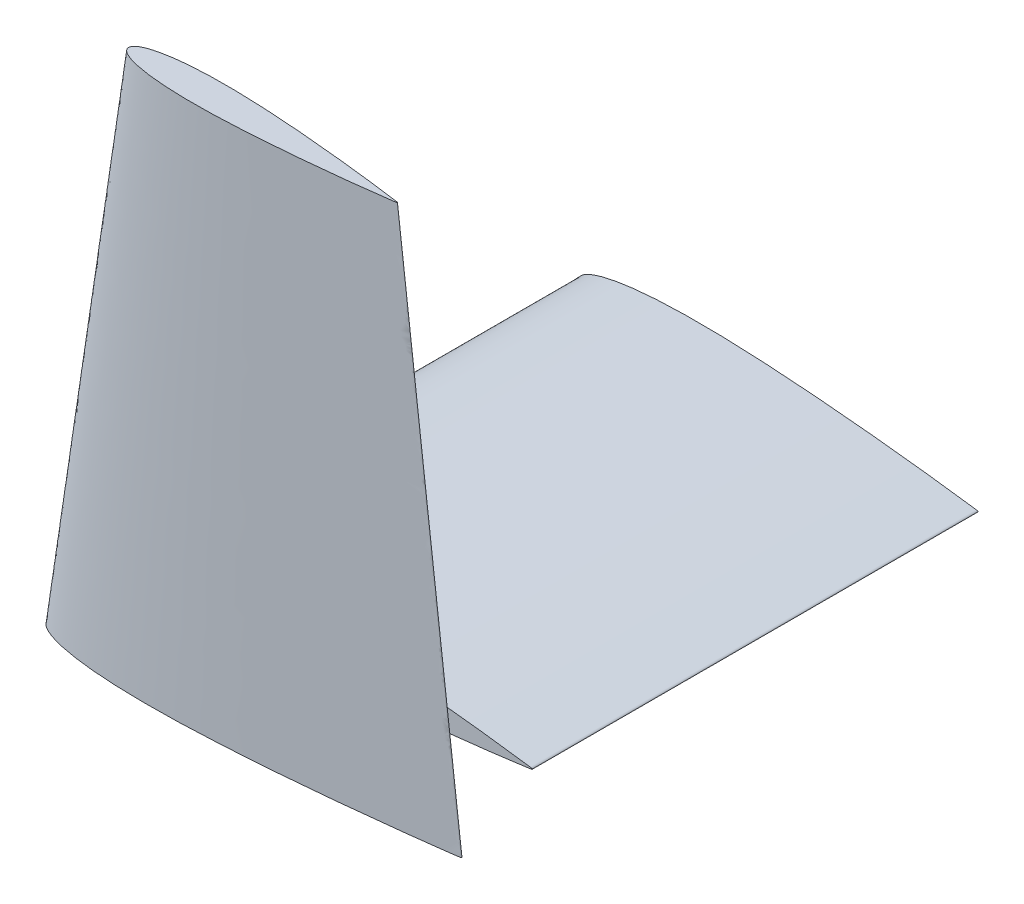
ISO-10303-21;
HEADER;
FILE_DESCRIPTION(('STEP AP214'),'2;1');
FILE_NAME('part.step','',(''),(''),'','','');
FILE_SCHEMA(('AUTOMOTIVE_DESIGN { 1 0 10303 214 1 1 1 1 }'));
ENDSEC;
DATA;
#1=APPLICATION_CONTEXT('core data for automotive mechanical design processes');
#2=APPLICATION_PROTOCOL_DEFINITION('international standard','automotive_design',2000,#1);
#3=PRODUCT_CONTEXT('',#1,'mechanical');
#4=PRODUCT('Part','Part','',(#3));
#5=PRODUCT_RELATED_PRODUCT_CATEGORY('part','',(#4));
#6=PRODUCT_DEFINITION_FORMATION('','',#4);
#7=PRODUCT_DEFINITION_CONTEXT('part definition',#1,'design');
#8=PRODUCT_DEFINITION('design','',#6,#7);
#9=PRODUCT_DEFINITION_SHAPE('','',#8);
#10=(LENGTH_UNIT() NAMED_UNIT(*) SI_UNIT(.MILLI.,.METRE.));
#11=(NAMED_UNIT(*) PLANE_ANGLE_UNIT() SI_UNIT($,.RADIAN.));
#12=(NAMED_UNIT(*) SI_UNIT($,.STERADIAN.) SOLID_ANGLE_UNIT());
#13=UNCERTAINTY_MEASURE_WITH_UNIT(LENGTH_MEASURE(1.E-05),#10,'distance_accuracy_value','');
#14=(GEOMETRIC_REPRESENTATION_CONTEXT(3) GLOBAL_UNCERTAINTY_ASSIGNED_CONTEXT((#13)) GLOBAL_UNIT_ASSIGNED_CONTEXT((#10,
#11,#12)) REPRESENTATION_CONTEXT('',''));
#15=CARTESIAN_POINT('',(0.,0.,0.));
#16=DIRECTION('',(0.,0.,1.));
#17=DIRECTION('',(1.,0.,0.));
#18=AXIS2_PLACEMENT_3D('',#15,#16,#17);
#19=CARTESIAN_POINT('',(25.4114796345118,365.759999999999,322.850976882838));
#20=DIRECTION('',(0.,1.,0.));
#21=DIRECTION('',(0.,0.,1.));
#22=AXIS2_PLACEMENT_3D('',#19,#20,#21);
#23=PLANE('',#22);
#24=CARTESIAN_POINT('',(239.522000000001,365.759999999999,322.310206280001));
#25=CARTESIAN_POINT('',(239.650719430013,365.759999999999,322.418074906855));
#26=CARTESIAN_POINT('',(239.650719430013,365.759999999999,322.94189803223));
#27=CARTESIAN_POINT('',(238.928971008814,365.759999999999,322.85351081366));
#28=CARTESIAN_POINT('',(238.014475706084,365.759999999999,323.110942112135));
#29=CARTESIAN_POINT('',(236.337412976432,365.759999999999,323.270058180235));
#30=CARTESIAN_POINT('',(234.078154780774,365.759999999999,323.611540782885));
#31=CARTESIAN_POINT('',(231.167891793945,365.759999999999,323.992612557069));
#32=CARTESIAN_POINT('',(227.658298365245,365.759999999999,324.462266000062));
#33=CARTESIAN_POINT('',(223.558505404651,365.759999999999,324.993164600283));
#34=CARTESIAN_POINT('',(218.898201345534,365.759999999999,325.584251359278));
#35=CARTESIAN_POINT('',(213.704622899695,365.759999999999,326.22517141355));
#36=CARTESIAN_POINT('',(208.010259265294,365.759999999999,326.907250831037));
#37=CARTESIAN_POINT('',(201.850111776308,365.759999999999,327.62202983624));
#38=CARTESIAN_POINT('',(195.262114854154,365.759999999999,328.359776891957));
#39=CARTESIAN_POINT('',(188.286908751653,365.759999999999,329.111484703838));
#40=CARTESIAN_POINT('',(180.967547263005,365.759999999999,329.867816964566));
#41=CARTESIAN_POINT('',(173.349138879148,365.759999999999,330.619011283575));
#42=CARTESIAN_POINT('',(165.478674392035,365.759999999999,331.354523149108));
#43=CARTESIAN_POINT('',(157.404623531842,365.759999999999,332.064696808186));
#44=CARTESIAN_POINT('',(149.176853772931,365.759999999999,332.737659428311));
#45=CARTESIAN_POINT('',(140.845921161843,365.759999999999,333.362438327104));
#46=CARTESIAN_POINT('',(132.463264355408,365.759999999999,333.927433985806));
#47=CARTESIAN_POINT('',(124.080532245958,365.759999999999,334.420832832673));
#48=CARTESIAN_POINT('',(115.749330838517,365.759999999999,334.830169767844));
#49=CARTESIAN_POINT('',(107.52111336693,365.759999999999,335.144529441153));
#50=CARTESIAN_POINT('',(99.4463721558172,365.759999999999,335.353656259887));
#51=CARTESIAN_POINT('',(91.5750074581309,365.759999999999,335.447335678217));
#52=CARTESIAN_POINT('',(83.9553855531787,365.759999999999,335.418133257889));
#53=CARTESIAN_POINT('',(76.6344833966962,365.759999999999,335.260408315323));
#54=CARTESIAN_POINT('',(69.657364483313,365.759999999999,334.970162695653));
#55=CARTESIAN_POINT('',(63.0669743171658,365.759999999999,334.546637161582));
#56=CARTESIAN_POINT('',(56.9038176761964,365.759999999999,333.991106073461));
#57=CARTESIAN_POINT('',(51.2056086917376,365.759999999999,333.307908152888));
#58=CARTESIAN_POINT('',(46.0070797735594,365.759999999999,332.50285640304));
#59=CARTESIAN_POINT('',(41.3397327494167,365.759999999999,331.58435890138));
#60=CARTESIAN_POINT('',(37.2309235824555,365.759999999999,330.56280134437));
#61=CARTESIAN_POINT('',(33.7040003089124,365.759999999999,329.448145192101));
#62=CARTESIAN_POINT('',(30.7768820130327,365.759999999999,328.250771918545));
#63=CARTESIAN_POINT('',(28.4589033564982,365.759999999999,326.978782316796));
#64=CARTESIAN_POINT('',(26.7536311559698,365.759999999999,325.62966587169));
#65=CARTESIAN_POINT('',(25.6614181855516,365.759999999999,324.170784390789));
#66=CARTESIAN_POINT('',(25.2781698309896,365.759999999999,322.580000000001));
#67=CARTESIAN_POINT('',(25.6614181855516,365.759999999999,320.989215609212));
#68=CARTESIAN_POINT('',(26.7536311559699,365.759999999999,319.530334128311));
#69=CARTESIAN_POINT('',(28.4589033564982,365.759999999999,318.181217683206));
#70=CARTESIAN_POINT('',(30.7768820130327,365.759999999999,316.909228081456));
#71=CARTESIAN_POINT('',(33.7040003089124,365.759999999999,315.7118548079));
#72=CARTESIAN_POINT('',(37.2309235824555,365.759999999999,314.597198655631));
#73=CARTESIAN_POINT('',(41.3397327494167,365.759999999999,313.575641098621));
#74=CARTESIAN_POINT('',(46.0070797735594,365.759999999999,312.657143596961));
#75=CARTESIAN_POINT('',(51.2056086917376,365.759999999999,311.852091847113));
#76=CARTESIAN_POINT('',(56.9038176761964,365.759999999999,311.16889392654));
#77=CARTESIAN_POINT('',(63.0669743171658,365.759999999999,310.61336283842));
#78=CARTESIAN_POINT('',(69.657364483313,365.759999999999,310.189837304349));
#79=CARTESIAN_POINT('',(76.6344833966962,365.759999999999,309.899591684678));
#80=CARTESIAN_POINT('',(83.9553855531787,365.759999999999,309.741866742113));
#81=CARTESIAN_POINT('',(91.5750074581309,365.759999999999,309.712664321784));
#82=CARTESIAN_POINT('',(99.4463721558172,365.759999999999,309.806343740114));
#83=CARTESIAN_POINT('',(107.52111336693,365.759999999999,310.015470558848));
#84=CARTESIAN_POINT('',(115.749330838517,365.759999999999,310.329830232157));
#85=CARTESIAN_POINT('',(124.080532245958,365.759999999999,310.739167167329));
#86=CARTESIAN_POINT('',(132.463264355408,365.759999999999,311.232566014195));
#87=CARTESIAN_POINT('',(140.845921161843,365.759999999999,311.797561672898));
#88=CARTESIAN_POINT('',(149.176853772931,365.759999999999,312.42234057169));
#89=CARTESIAN_POINT('',(157.404623531842,365.759999999999,313.095303191815));
#90=CARTESIAN_POINT('',(165.478674392035,365.759999999999,313.805476850894));
#91=CARTESIAN_POINT('',(173.349138879148,365.759999999999,314.540988716426));
#92=CARTESIAN_POINT('',(180.967547263005,365.759999999999,315.292183035435));
#93=CARTESIAN_POINT('',(188.286908751653,365.759999999999,316.048515296164));
#94=CARTESIAN_POINT('',(195.262114854154,365.759999999999,316.800223108044));
#95=CARTESIAN_POINT('',(201.850111776308,365.759999999999,317.537970163762));
#96=CARTESIAN_POINT('',(208.010259265294,365.759999999999,318.252749168964));
#97=CARTESIAN_POINT('',(213.704622899695,365.759999999999,318.934828586451));
#98=CARTESIAN_POINT('',(218.898201345534,365.759999999999,319.575748640723));
#99=CARTESIAN_POINT('',(223.558505404651,365.759999999999,320.166835399719));
#100=CARTESIAN_POINT('',(227.658298365245,365.759999999999,320.697733999939));
#101=CARTESIAN_POINT('',(231.167891793945,365.759999999999,321.167387442933));
#102=CARTESIAN_POINT('',(234.078154780774,365.759999999999,321.548459217116));
#103=CARTESIAN_POINT('',(236.337412976431,365.759999999999,321.889941819767));
#104=CARTESIAN_POINT('',(238.014475706085,365.759999999999,322.049057887867));
#105=CARTESIAN_POINT('',(238.928971008813,365.759999999999,322.306489186341));
#106=CARTESIAN_POINT('',(239.442517560816,365.759999999999,322.243598918757));
#107=CARTESIAN_POINT('',(239.522000000001,365.759999999999,322.310206280001));
#108=B_SPLINE_CURVE_WITH_KNOTS('',3,(#24,#25,#26,#27,#28,#29,#30,#31,#32,#33,#34,#35,#36,#37,
#38,#39,#40,#41,#42,#43,#44,#45,#46,#47,#48,#49,#50,#51,#52,#53,#54,#55,#56,#57,#58,#59,#60,#61,
#62,#63,#64,#65,#66,#67,#68,#69,#70,#71,#72,#73,#74,#75,#76,#77,#78,#79,#80,#81,#82,#83,#84,#85,
#86,#87,#88,#89,#90,#91,#92,#93,#94,#95,#96,#97,#98,#99,#100,#101,#102,#103,#104,#105,#106,
#107),.UNSPECIFIED.,.T.,.F.,(4,1,1,1,1,1,1,1,1,1,1,1,1,1,1,1,1,1,1,1,1,1,1,1,1,1,1,1,1,1,1,1,1,
1,1,1,1,1,1,1,1,1,1,1,1,1,1,1,1,1,1,1,1,1,1,1,1,1,1,1,1,1,1,1,1,1,1,1,1,1,1,1,1,1,1,1,1,1,1,1,1,
4),(0.,0.0012343838014236,0.00199659845245215,0.00427909011224525,0.00806662934455282,
0.0133355596051821,0.0200519194601093,0.0281738385945457,0.0376492320599804,0.04841901239702,
0.0604147969012383,0.073562257415336,0.0877784448905718,0.102974964137976,0.119057720234998,
0.135925836009746,0.153474538248578,0.17159567376606,0.190175391650966,0.209099819247063,
0.228250461823925,0.247510079781424,0.266759327051319,0.285879349911867,0.304754502070085,
0.323268959175755,0.341312736715542,0.358776977043126,0.375559865722258,0.391564274673312,
0.406698273540518,0.420878185247108,0.434027755192764,0.44607820054461,0.456972304506158,
0.466663037034508,0.475120703886839,0.482336017878992,0.488336068220102,0.493209752146517,
0.497165061608803,0.500617191900712,0.504069322192621,0.508024631654908,0.512898315581322,
0.518898365922432,0.526113679914584,0.534571346766916,0.544262079295266,0.555156183256814,
0.56720662860866,0.580356198554316,0.594536110260906,0.609670109128112,0.625674518079166,
0.642457406758298,0.659921647085882,0.677965424625669,0.696479881731339,0.715355033889556,
0.734475056750105,0.753724304019999,0.772983921977499,0.792134564554361,0.811058992150458,
0.829638710035363,0.847759845552846,0.865308547791678,0.882176663566426,0.898259419663447,
0.913455938910852,0.927672126386088,0.940819586900185,0.952815371404404,0.963585151741443,
0.973060545206878,0.981182464341314,0.987898824196242,0.993167754456871,0.996955293689178,
0.999237785348971,1.),.UNSPECIFIED.);
#109=CARTESIAN_POINT('',(239.522000000001,365.759999999999,322.310206280001));
#110=VERTEX_POINT('',#109);
#111=EDGE_CURVE('E12',#110,#110,#108,.T.);
#112=ORIENTED_EDGE('',*,*,#111,.F.);
#113=EDGE_LOOP('',(#112));
#114=FACE_BOUND('',#113,.T.);
#115=ADVANCED_FACE('F53',(#114),#23,.T.);
#116=CARTESIAN_POINT('',(-38.0823652115158,-60.9600000000007,322.996269351453));
#117=DIRECTION('',(0.,-1.,0.));
#118=DIRECTION('',(0.,0.,-1.));
#119=AXIS2_PLACEMENT_3D('',#116,#117,#118);
#120=PLANE('',#119);
#121=CARTESIAN_POINT('',(290.830000000001,-60.9600000000009,322.1655482));
#122=CARTESIAN_POINT('',(290.70790064206,-60.9600000000009,322.063227283262));
#123=CARTESIAN_POINT('',(289.919000541415,-60.9600000000009,322.159838073916));
#124=CARTESIAN_POINT('',(288.514170865218,-60.9600000000009,321.764377182428));
#125=CARTESIAN_POINT('',(285.937900123936,-60.9600000000009,321.519946211859));
#126=CARTESIAN_POINT('',(282.467272172126,-60.9600000000009,320.995367361999));
#127=CARTESIAN_POINT('',(277.996583479429,-60.9600000000009,320.409972406402));
#128=CARTESIAN_POINT('',(272.605215163692,-60.9600000000009,319.688500035493));
#129=CARTESIAN_POINT('',(266.307193949018,-60.9600000000009,318.872944060065));
#130=CARTESIAN_POINT('',(259.148126622142,-60.9600000000009,317.964928220327));
#131=CARTESIAN_POINT('',(251.169853683398,-60.9600000000008,316.980359453681));
#132=CARTESIAN_POINT('',(242.422284399235,-60.9600000000008,315.932562483759));
#133=CARTESIAN_POINT('',(232.959187129677,-60.9600000000008,314.834533051092));
#134=CARTESIAN_POINT('',(222.838835985917,-60.9600000000008,313.701220551503));
#135=CARTESIAN_POINT('',(212.123661724069,-60.9600000000008,312.546461813204));
#136=CARTESIAN_POINT('',(200.879802734983,-60.9600000000008,311.384599087649));
#137=CARTESIAN_POINT('',(189.176553794183,-60.9600000000008,310.230629166988));
#138=CARTESIAN_POINT('',(177.086101230943,-60.9600000000008,309.100750322547));
#139=CARTESIAN_POINT('',(164.682903290314,-60.9600000000008,308.00979553191));
#140=CARTESIAN_POINT('',(152.043565404443,-60.9600000000008,306.97600360657));
#141=CARTESIAN_POINT('',(139.245750776495,-60.9600000000008,306.016230565127));
#142=CARTESIAN_POINT('',(126.368478458188,-60.9600000000008,305.148295359884));
#143=CARTESIAN_POINT('',(113.491090460871,-60.9600000000007,304.390345767129));
#144=CARTESIAN_POINT('',(100.69286291326,-60.9600000000007,303.761530427809));
#145=CARTESIAN_POINT('',(88.0528372599928,-60.9600000000007,303.27861728791));
#146=CARTESIAN_POINT('',(75.6485788158751,-60.9600000000007,302.957360787008));
#147=CARTESIAN_POINT('',(63.556743366879,-60.9600000000007,302.813452309264));
#148=CARTESIAN_POINT('',(51.8516302388682,-60.9600000000007,302.858312492331));
#149=CARTESIAN_POINT('',(40.6054045061933,-60.9600000000007,303.100606443248));
#150=CARTESIAN_POINT('',(29.8872918219332,-60.9600000000007,303.546476048791));
#151=CARTESIAN_POINT('',(19.7632642238779,-60.9600000000007,304.197087634345));
#152=CARTESIAN_POINT('',(10.2955443542987,-60.9600000000007,305.050483552633));
#153=CARTESIAN_POINT('',(1.54206791909804,-60.9600000000007,306.099998744972));
#154=CARTESIAN_POINT('',(-6.44380983777141,-60.9600000000007,307.336703390349));
#155=CARTESIAN_POINT('',(-13.6136964288326,-60.9600000000007,308.747681165734));
#156=CARTESIAN_POINT('',(-19.9255681621837,-60.9600000000007,310.316977768732));
#157=CARTESIAN_POINT('',(-25.3435582443167,-60.9600000000007,312.02929060051));
#158=CARTESIAN_POINT('',(-29.8401397308699,-60.9600000000007,313.868671845178));
#159=CARTESIAN_POINT('',(-33.4009728983814,-60.9600000000007,315.822677223904));
#160=CARTESIAN_POINT('',(-36.0205784733329,-60.9600000000007,317.895163340644));
#161=CARTESIAN_POINT('',(-37.6984145310929,-60.9600000000007,320.136268343926));
#162=CARTESIAN_POINT('',(-38.2871531066062,-60.9600000000007,322.58));
#163=CARTESIAN_POINT('',(-37.6984145310929,-60.9600000000007,325.023731656075));
#164=CARTESIAN_POINT('',(-36.0205784733329,-60.9600000000007,327.264836659357));
#165=CARTESIAN_POINT('',(-33.4009728983813,-60.9600000000007,329.337322776097));
#166=CARTESIAN_POINT('',(-29.8401397308699,-60.9600000000007,331.291328154822));
#167=CARTESIAN_POINT('',(-25.3435582443167,-60.9600000000007,333.130709399491));
#168=CARTESIAN_POINT('',(-19.9255681621836,-60.9600000000007,334.843022231268));
#169=CARTESIAN_POINT('',(-13.6136964288326,-60.9600000000007,336.412318834266));
#170=CARTESIAN_POINT('',(-6.44380983777134,-60.9600000000007,337.823296609652));
#171=CARTESIAN_POINT('',(1.542067919098,-60.9600000000007,339.060001255029));
#172=CARTESIAN_POINT('',(10.2955443542987,-60.9600000000007,340.109516447368));
#173=CARTESIAN_POINT('',(19.7632642238779,-60.9600000000007,340.962912365656));
#174=CARTESIAN_POINT('',(29.8872918219332,-60.9600000000007,341.613523951209));
#175=CARTESIAN_POINT('',(40.6054045061933,-60.9600000000007,342.059393556753));
#176=CARTESIAN_POINT('',(51.8516302388681,-60.9600000000007,342.301687507669));
#177=CARTESIAN_POINT('',(63.556743366879,-60.9600000000007,342.346547690736));
#178=CARTESIAN_POINT('',(75.648578815875,-60.9600000000007,342.202639212993));
#179=CARTESIAN_POINT('',(88.0528372599928,-60.9600000000008,341.881382712091));
#180=CARTESIAN_POINT('',(100.69286291326,-60.9600000000008,341.398469572192));
#181=CARTESIAN_POINT('',(113.491090460871,-60.9600000000008,340.769654232872));
#182=CARTESIAN_POINT('',(126.368478458188,-60.9600000000008,340.011704640117));
#183=CARTESIAN_POINT('',(139.245750776495,-60.9600000000008,339.143769434874));
#184=CARTESIAN_POINT('',(152.043565404443,-60.9600000000008,338.183996393431));
#185=CARTESIAN_POINT('',(164.682903290314,-60.9600000000008,337.150204468091));
#186=CARTESIAN_POINT('',(177.086101230943,-60.9600000000008,336.059249677454));
#187=CARTESIAN_POINT('',(189.176553794183,-60.9600000000008,334.929370833012));
#188=CARTESIAN_POINT('',(200.879802734983,-60.9600000000008,333.775400912352));
#189=CARTESIAN_POINT('',(212.123661724069,-60.9600000000008,332.613538186796));
#190=CARTESIAN_POINT('',(222.838835985917,-60.9600000000008,331.458779448498));
#191=CARTESIAN_POINT('',(232.959187129677,-60.9600000000008,330.325466948909));
#192=CARTESIAN_POINT('',(242.422284399235,-60.9600000000008,329.227437516242));
#193=CARTESIAN_POINT('',(251.169853683398,-60.9600000000009,328.179640546319));
#194=CARTESIAN_POINT('',(259.148126622142,-60.9600000000009,327.195071779673));
#195=CARTESIAN_POINT('',(266.307193949018,-60.9600000000009,326.287055939936));
#196=CARTESIAN_POINT('',(272.605215163692,-60.9600000000009,325.471499964508));
#197=CARTESIAN_POINT('',(277.996583479429,-60.9600000000009,324.750027593598));
#198=CARTESIAN_POINT('',(282.467272172126,-60.9600000000009,324.164632638002));
#199=CARTESIAN_POINT('',(285.937900123936,-60.9600000000009,323.640053788142));
#200=CARTESIAN_POINT('',(288.514170865218,-60.9600000000009,323.395622817573));
#201=CARTESIAN_POINT('',(289.919000541415,-60.9600000000009,323.000161926084));
#202=CARTESIAN_POINT('',(291.027736253697,-60.9600000000009,323.135940630769));
#203=CARTESIAN_POINT('',(291.027736253697,-60.9600000000009,322.331253860471));
#204=CARTESIAN_POINT('',(290.830000000001,-60.9600000000009,322.1655482));
#205=B_SPLINE_CURVE_WITH_KNOTS('',3,(#121,#122,#123,#124,#125,#126,#127,#128,#129,#130,#131,
#132,#133,#134,#135,#136,#137,#138,#139,#140,#141,#142,#143,#144,#145,#146,#147,#148,#149,#150,
#151,#152,#153,#154,#155,#156,#157,#158,#159,#160,#161,#162,#163,#164,#165,#166,#167,#168,#169,
#170,#171,#172,#173,#174,#175,#176,#177,#178,#179,#180,#181,#182,#183,#184,#185,#186,#187,#188,
#189,#190,#191,#192,#193,#194,#195,#196,#197,#198,#199,#200,#201,#202,#203,#204),.UNSPECIFIED.,
.T.,.F.,(4,1,1,1,1,1,1,1,1,1,1,1,1,1,1,1,1,1,1,1,1,1,1,1,1,1,1,1,1,1,1,1,1,1,1,1,1,1,1,1,1,1,1,
1,1,1,1,1,1,1,1,1,1,1,1,1,1,1,1,1,1,1,1,1,1,1,1,1,1,1,1,1,1,1,1,1,1,1,1,1,1,4),(0.,
0.000762214651028602,0.00304470631082167,0.00683224554312916,0.0121011758037585,
0.0188175356586858,0.026939454793122,0.0364148482585568,0.0471846285955963,0.0591804130998148,
0.0723278736139124,0.0865440610891483,0.101740580336553,0.117823336433574,0.134691452208322,
0.152240154447155,0.170361289964637,0.188941007849542,0.207865435445639,0.227016078022501,
0.246275695980001,0.265524943249896,0.284644966110444,0.303520118268662,0.322034575374331,
0.340078352914118,0.357542593241702,0.374325481920834,0.390329890871888,0.405463889739095,
0.419643801445685,0.43279337139134,0.444843816743186,0.455737920704734,0.465428653233084,
0.473886320085416,0.481101634077568,0.487101684418678,0.491975368345093,0.495930677807379,
0.499382808099288,0.502834938391198,0.506790247853484,0.511663931779899,0.517663982121008,
0.524879296113161,0.533336962965492,0.543027695493843,0.553921799455391,0.565972244807237,
0.579121814752892,0.593301726459482,0.608435725326689,0.624440134277742,0.641223022956875,
0.658687263284458,0.676731040824245,0.695245497929915,0.714120650088133,0.733240672948681,
0.752489920218576,0.771749538176075,0.790900180752937,0.809824608349034,0.82840432623394,
0.846525461751422,0.864074163990254,0.880942279765002,0.897025035862024,0.912221555109428,
0.926437742584664,0.939585203098762,0.95158098760298,0.96235076794002,0.971826161405455,
0.979948080539891,0.986664440394818,0.991933370655447,0.995720909887755,0.998003401547548,
0.998765616198576,1.),.UNSPECIFIED.);
#206=CARTESIAN_POINT('',(290.830000000001,-60.9600000000009,322.1655482));
#207=VERTEX_POINT('',#206);
#208=EDGE_CURVE('E63',#207,#207,#205,.T.);
#209=ORIENTED_EDGE('',*,*,#208,.F.);
#210=EDGE_LOOP('',(#209));
#211=FACE_BOUND('',#210,.T.);
#212=ADVANCED_FACE('F93',(#211),#120,.T.);
#213=CARTESIAN_POINT('',(290.830000000001,-60.9600000000009,322.1655482));
#214=CARTESIAN_POINT('',(239.522000000001,365.759999999999,322.310206280001));
#215=CARTESIAN_POINT('',(290.70790064206,-60.9600000000009,322.063227283262));
#216=CARTESIAN_POINT('',(239.442517560816,365.759999999999,322.243598918757));
#217=CARTESIAN_POINT('',(289.919000541415,-60.9600000000009,322.159838073916));
#218=CARTESIAN_POINT('',(238.928971008813,365.759999999999,322.306489186341));
#219=CARTESIAN_POINT('',(288.514170865218,-60.9600000000009,321.764377182428));
#220=CARTESIAN_POINT('',(238.014475706085,365.759999999999,322.049057887867));
#221=CARTESIAN_POINT('',(285.937900123936,-60.9600000000009,321.519946211859));
#222=CARTESIAN_POINT('',(236.337412976431,365.759999999999,321.889941819767));
#223=CARTESIAN_POINT('',(282.467272172126,-60.9600000000009,320.995367361999));
#224=CARTESIAN_POINT('',(234.078154780774,365.759999999999,321.548459217116));
#225=CARTESIAN_POINT('',(277.996583479429,-60.9600000000009,320.409972406402));
#226=CARTESIAN_POINT('',(231.167891793945,365.759999999999,321.167387442933));
#227=CARTESIAN_POINT('',(272.605215163692,-60.9600000000009,319.688500035493));
#228=CARTESIAN_POINT('',(227.658298365245,365.759999999999,320.697733999939));
#229=CARTESIAN_POINT('',(266.307193949018,-60.9600000000009,318.872944060065));
#230=CARTESIAN_POINT('',(223.558505404651,365.759999999999,320.166835399719));
#231=CARTESIAN_POINT('',(259.148126622142,-60.9600000000009,317.964928220327));
#232=CARTESIAN_POINT('',(218.898201345534,365.759999999999,319.575748640723));
#233=CARTESIAN_POINT('',(251.169853683398,-60.9600000000008,316.980359453681));
#234=CARTESIAN_POINT('',(213.704622899695,365.759999999999,318.934828586451));
#235=CARTESIAN_POINT('',(242.422284399235,-60.9600000000008,315.932562483759));
#236=CARTESIAN_POINT('',(208.010259265294,365.759999999999,318.252749168964));
#237=CARTESIAN_POINT('',(232.959187129677,-60.9600000000008,314.834533051092));
#238=CARTESIAN_POINT('',(201.850111776308,365.759999999999,317.537970163762));
#239=CARTESIAN_POINT('',(222.838835985917,-60.9600000000008,313.701220551503));
#240=CARTESIAN_POINT('',(195.262114854154,365.759999999999,316.800223108044));
#241=CARTESIAN_POINT('',(212.123661724069,-60.9600000000008,312.546461813204));
#242=CARTESIAN_POINT('',(188.286908751653,365.759999999999,316.048515296164));
#243=CARTESIAN_POINT('',(200.879802734983,-60.9600000000008,311.384599087649));
#244=CARTESIAN_POINT('',(180.967547263005,365.759999999999,315.292183035435));
#245=CARTESIAN_POINT('',(189.176553794183,-60.9600000000008,310.230629166988));
#246=CARTESIAN_POINT('',(173.349138879148,365.759999999999,314.540988716426));
#247=CARTESIAN_POINT('',(177.086101230943,-60.9600000000008,309.100750322547));
#248=CARTESIAN_POINT('',(165.478674392035,365.759999999999,313.805476850894));
#249=CARTESIAN_POINT('',(164.682903290314,-60.9600000000008,308.00979553191));
#250=CARTESIAN_POINT('',(157.404623531842,365.759999999999,313.095303191815));
#251=CARTESIAN_POINT('',(152.043565404443,-60.9600000000008,306.97600360657));
#252=CARTESIAN_POINT('',(149.176853772931,365.759999999999,312.42234057169));
#253=CARTESIAN_POINT('',(139.245750776495,-60.9600000000008,306.016230565127));
#254=CARTESIAN_POINT('',(140.845921161843,365.759999999999,311.797561672898));
#255=CARTESIAN_POINT('',(126.368478458188,-60.9600000000008,305.148295359884));
#256=CARTESIAN_POINT('',(132.463264355408,365.759999999999,311.232566014195));
#257=CARTESIAN_POINT('',(113.491090460871,-60.9600000000007,304.390345767129));
#258=CARTESIAN_POINT('',(124.080532245958,365.759999999999,310.739167167329));
#259=CARTESIAN_POINT('',(100.69286291326,-60.9600000000007,303.761530427809));
#260=CARTESIAN_POINT('',(115.749330838517,365.759999999999,310.329830232157));
#261=CARTESIAN_POINT('',(88.0528372599928,-60.9600000000007,303.27861728791));
#262=CARTESIAN_POINT('',(107.52111336693,365.759999999999,310.015470558848));
#263=CARTESIAN_POINT('',(75.6485788158751,-60.9600000000007,302.957360787008));
#264=CARTESIAN_POINT('',(99.4463721558172,365.759999999999,309.806343740114));
#265=CARTESIAN_POINT('',(63.556743366879,-60.9600000000007,302.813452309264));
#266=CARTESIAN_POINT('',(91.5750074581309,365.759999999999,309.712664321784));
#267=CARTESIAN_POINT('',(51.8516302388682,-60.9600000000007,302.858312492331));
#268=CARTESIAN_POINT('',(83.9553855531787,365.759999999999,309.741866742113));
#269=CARTESIAN_POINT('',(40.6054045061933,-60.9600000000007,303.100606443248));
#270=CARTESIAN_POINT('',(76.6344833966962,365.759999999999,309.899591684678));
#271=CARTESIAN_POINT('',(29.8872918219332,-60.9600000000007,303.546476048791));
#272=CARTESIAN_POINT('',(69.657364483313,365.759999999999,310.189837304349));
#273=CARTESIAN_POINT('',(19.7632642238779,-60.9600000000007,304.197087634345));
#274=CARTESIAN_POINT('',(63.0669743171658,365.759999999999,310.61336283842));
#275=CARTESIAN_POINT('',(10.2955443542987,-60.9600000000007,305.050483552633));
#276=CARTESIAN_POINT('',(56.9038176761964,365.759999999999,311.16889392654));
#277=CARTESIAN_POINT('',(1.54206791909804,-60.9600000000007,306.099998744972));
#278=CARTESIAN_POINT('',(51.2056086917376,365.759999999999,311.852091847113));
#279=CARTESIAN_POINT('',(-6.44380983777141,-60.9600000000007,307.336703390349));
#280=CARTESIAN_POINT('',(46.0070797735594,365.759999999999,312.657143596961));
#281=CARTESIAN_POINT('',(-13.6136964288326,-60.9600000000007,308.747681165734));
#282=CARTESIAN_POINT('',(41.3397327494167,365.759999999999,313.575641098621));
#283=CARTESIAN_POINT('',(-19.9255681621837,-60.9600000000007,310.316977768732));
#284=CARTESIAN_POINT('',(37.2309235824555,365.759999999999,314.597198655631));
#285=CARTESIAN_POINT('',(-25.3435582443167,-60.9600000000007,312.02929060051));
#286=CARTESIAN_POINT('',(33.7040003089124,365.759999999999,315.7118548079));
#287=CARTESIAN_POINT('',(-29.8401397308699,-60.9600000000007,313.868671845178));
#288=CARTESIAN_POINT('',(30.7768820130327,365.759999999999,316.909228081456));
#289=CARTESIAN_POINT('',(-33.4009728983814,-60.9600000000007,315.822677223904));
#290=CARTESIAN_POINT('',(28.4589033564982,365.759999999999,318.181217683206));
#291=CARTESIAN_POINT('',(-36.0205784733329,-60.9600000000007,317.895163340644));
#292=CARTESIAN_POINT('',(26.7536311559699,365.759999999999,319.530334128311));
#293=CARTESIAN_POINT('',(-37.6984145310929,-60.9600000000007,320.136268343926));
#294=CARTESIAN_POINT('',(25.6614181855516,365.759999999999,320.989215609212));
#295=CARTESIAN_POINT('',(-38.2871531066062,-60.9600000000007,322.58));
#296=CARTESIAN_POINT('',(25.2781698309896,365.759999999999,322.580000000001));
#297=CARTESIAN_POINT('',(-37.6984145310929,-60.9600000000007,325.023731656075));
#298=CARTESIAN_POINT('',(25.6614181855516,365.759999999999,324.170784390789));
#299=CARTESIAN_POINT('',(-36.0205784733329,-60.9600000000007,327.264836659357));
#300=CARTESIAN_POINT('',(26.7536311559698,365.759999999999,325.62966587169));
#301=CARTESIAN_POINT('',(-33.4009728983813,-60.9600000000007,329.337322776097));
#302=CARTESIAN_POINT('',(28.4589033564982,365.759999999999,326.978782316796));
#303=CARTESIAN_POINT('',(-29.8401397308699,-60.9600000000007,331.291328154822));
#304=CARTESIAN_POINT('',(30.7768820130327,365.759999999999,328.250771918545));
#305=CARTESIAN_POINT('',(-25.3435582443167,-60.9600000000007,333.130709399491));
#306=CARTESIAN_POINT('',(33.7040003089124,365.759999999999,329.448145192101));
#307=CARTESIAN_POINT('',(-19.9255681621836,-60.9600000000007,334.843022231268));
#308=CARTESIAN_POINT('',(37.2309235824555,365.759999999999,330.56280134437));
#309=CARTESIAN_POINT('',(-13.6136964288326,-60.9600000000007,336.412318834266));
#310=CARTESIAN_POINT('',(41.3397327494167,365.759999999999,331.58435890138));
#311=CARTESIAN_POINT('',(-6.44380983777134,-60.9600000000007,337.823296609652));
#312=CARTESIAN_POINT('',(46.0070797735594,365.759999999999,332.50285640304));
#313=CARTESIAN_POINT('',(1.542067919098,-60.9600000000007,339.060001255029));
#314=CARTESIAN_POINT('',(51.2056086917376,365.759999999999,333.307908152888));
#315=CARTESIAN_POINT('',(10.2955443542987,-60.9600000000007,340.109516447368));
#316=CARTESIAN_POINT('',(56.9038176761964,365.759999999999,333.991106073461));
#317=CARTESIAN_POINT('',(19.7632642238779,-60.9600000000007,340.962912365656));
#318=CARTESIAN_POINT('',(63.0669743171658,365.759999999999,334.546637161582));
#319=CARTESIAN_POINT('',(29.8872918219332,-60.9600000000007,341.613523951209));
#320=CARTESIAN_POINT('',(69.657364483313,365.759999999999,334.970162695653));
#321=CARTESIAN_POINT('',(40.6054045061933,-60.9600000000007,342.059393556753));
#322=CARTESIAN_POINT('',(76.6344833966962,365.759999999999,335.260408315323));
#323=CARTESIAN_POINT('',(51.8516302388681,-60.9600000000007,342.301687507669));
#324=CARTESIAN_POINT('',(83.9553855531787,365.759999999999,335.418133257889));
#325=CARTESIAN_POINT('',(63.556743366879,-60.9600000000007,342.346547690736));
#326=CARTESIAN_POINT('',(91.5750074581309,365.759999999999,335.447335678217));
#327=CARTESIAN_POINT('',(75.648578815875,-60.9600000000007,342.202639212993));
#328=CARTESIAN_POINT('',(99.4463721558172,365.759999999999,335.353656259887));
#329=CARTESIAN_POINT('',(88.0528372599928,-60.9600000000008,341.881382712091));
#330=CARTESIAN_POINT('',(107.52111336693,365.759999999999,335.144529441153));
#331=CARTESIAN_POINT('',(100.69286291326,-60.9600000000008,341.398469572192));
#332=CARTESIAN_POINT('',(115.749330838517,365.759999999999,334.830169767844));
#333=CARTESIAN_POINT('',(113.491090460871,-60.9600000000008,340.769654232872));
#334=CARTESIAN_POINT('',(124.080532245958,365.759999999999,334.420832832673));
#335=CARTESIAN_POINT('',(126.368478458188,-60.9600000000008,340.011704640117));
#336=CARTESIAN_POINT('',(132.463264355408,365.759999999999,333.927433985806));
#337=CARTESIAN_POINT('',(139.245750776495,-60.9600000000008,339.143769434874));
#338=CARTESIAN_POINT('',(140.845921161843,365.759999999999,333.362438327104));
#339=CARTESIAN_POINT('',(152.043565404443,-60.9600000000008,338.183996393431));
#340=CARTESIAN_POINT('',(149.176853772931,365.759999999999,332.737659428311));
#341=CARTESIAN_POINT('',(164.682903290314,-60.9600000000008,337.150204468091));
#342=CARTESIAN_POINT('',(157.404623531842,365.759999999999,332.064696808186));
#343=CARTESIAN_POINT('',(177.086101230943,-60.9600000000008,336.059249677454));
#344=CARTESIAN_POINT('',(165.478674392035,365.759999999999,331.354523149108));
#345=CARTESIAN_POINT('',(189.176553794183,-60.9600000000008,334.929370833012));
#346=CARTESIAN_POINT('',(173.349138879148,365.759999999999,330.619011283575));
#347=CARTESIAN_POINT('',(200.879802734983,-60.9600000000008,333.775400912352));
#348=CARTESIAN_POINT('',(180.967547263005,365.759999999999,329.867816964566));
#349=CARTESIAN_POINT('',(212.123661724069,-60.9600000000008,332.613538186796));
#350=CARTESIAN_POINT('',(188.286908751653,365.759999999999,329.111484703838));
#351=CARTESIAN_POINT('',(222.838835985917,-60.9600000000008,331.458779448498));
#352=CARTESIAN_POINT('',(195.262114854154,365.759999999999,328.359776891957));
#353=CARTESIAN_POINT('',(232.959187129677,-60.9600000000008,330.325466948909));
#354=CARTESIAN_POINT('',(201.850111776308,365.759999999999,327.62202983624));
#355=CARTESIAN_POINT('',(242.422284399235,-60.9600000000008,329.227437516242));
#356=CARTESIAN_POINT('',(208.010259265294,365.759999999999,326.907250831037));
#357=CARTESIAN_POINT('',(251.169853683398,-60.9600000000009,328.179640546319));
#358=CARTESIAN_POINT('',(213.704622899695,365.759999999999,326.22517141355));
#359=CARTESIAN_POINT('',(259.148126622142,-60.9600000000009,327.195071779673));
#360=CARTESIAN_POINT('',(218.898201345534,365.759999999999,325.584251359278));
#361=CARTESIAN_POINT('',(266.307193949018,-60.9600000000009,326.287055939936));
#362=CARTESIAN_POINT('',(223.558505404651,365.759999999999,324.993164600283));
#363=CARTESIAN_POINT('',(272.605215163692,-60.9600000000009,325.471499964508));
#364=CARTESIAN_POINT('',(227.658298365245,365.759999999999,324.462266000062));
#365=CARTESIAN_POINT('',(277.996583479429,-60.9600000000009,324.750027593598));
#366=CARTESIAN_POINT('',(231.167891793945,365.759999999999,323.992612557069));
#367=CARTESIAN_POINT('',(282.467272172126,-60.9600000000009,324.164632638002));
#368=CARTESIAN_POINT('',(234.078154780774,365.759999999999,323.611540782885));
#369=CARTESIAN_POINT('',(285.937900123936,-60.9600000000009,323.640053788142));
#370=CARTESIAN_POINT('',(236.337412976432,365.759999999999,323.270058180235));
#371=CARTESIAN_POINT('',(288.514170865218,-60.9600000000009,323.395622817573));
#372=CARTESIAN_POINT('',(238.014475706084,365.759999999999,323.110942112135));
#373=CARTESIAN_POINT('',(289.919000541415,-60.9600000000009,323.000161926084));
#374=CARTESIAN_POINT('',(238.928971008814,365.759999999999,322.85351081366));
#375=CARTESIAN_POINT('',(291.027736253697,-60.9600000000009,323.135940630769));
#376=CARTESIAN_POINT('',(239.650719430013,365.759999999999,322.94189803223));
#377=CARTESIAN_POINT('',(291.027736253697,-60.9600000000009,322.331253860471));
#378=CARTESIAN_POINT('',(239.650719430013,365.759999999999,322.418074906855));
#379=CARTESIAN_POINT('',(290.830000000001,-60.9600000000009,322.1655482));
#380=CARTESIAN_POINT('',(239.522000000001,365.759999999999,322.310206280001));
#381=B_SPLINE_SURFACE_WITH_KNOTS('',3,1,((#213,#214),(#215,#216),(#217,#218),(#219,#220),(#221,
#222),(#223,#224),(#225,#226),(#227,#228),(#229,#230),(#231,#232),(#233,#234),(#235,#236),(#237,
#238),(#239,#240),(#241,#242),(#243,#244),(#245,#246),(#247,#248),(#249,#250),(#251,#252),(#253,
#254),(#255,#256),(#257,#258),(#259,#260),(#261,#262),(#263,#264),(#265,#266),(#267,#268),(#269,
#270),(#271,#272),(#273,#274),(#275,#276),(#277,#278),(#279,#280),(#281,#282),(#283,#284),(#285,
#286),(#287,#288),(#289,#290),(#291,#292),(#293,#294),(#295,#296),(#297,#298),(#299,#300),(#301,
#302),(#303,#304),(#305,#306),(#307,#308),(#309,#310),(#311,#312),(#313,#314),(#315,#316),(#317,
#318),(#319,#320),(#321,#322),(#323,#324),(#325,#326),(#327,#328),(#329,#330),(#331,#332),(#333,
#334),(#335,#336),(#337,#338),(#339,#340),(#341,#342),(#343,#344),(#345,#346),(#347,#348),(#349,
#350),(#351,#352),(#353,#354),(#355,#356),(#357,#358),(#359,#360),(#361,#362),(#363,#364),(#365,
#366),(#367,#368),(#369,#370),(#371,#372),(#373,#374),(#375,#376),(#377,#378),(#379,#380)),
.UNSPECIFIED.,.T.,.F.,.F.,(4,1,1,1,1,1,1,1,1,1,1,1,1,1,1,1,1,1,1,1,1,1,1,1,1,1,1,1,1,1,1,1,1,1,
1,1,1,1,1,1,1,1,1,1,1,1,1,1,1,1,1,1,1,1,1,1,1,1,1,1,1,1,1,1,1,1,1,1,1,1,1,1,1,1,1,1,1,1,1,1,1,
4),(2,2),(0.,0.000762214651028548,0.00304470631082167,0.00683224554312916,0.0121011758037585,
0.0188175356586858,0.026939454793122,0.0364148482585568,0.0471846285955963,0.0591804130998148,
0.0723278736139124,0.0865440610891483,0.101740580336553,0.117823336433574,0.134691452208322,
0.152240154447155,0.170361289964637,0.188941007849542,0.207865435445639,0.227016078022501,
0.246275695980001,0.265524943249896,0.284644966110444,0.303520118268662,0.322034575374331,
0.340078352914118,0.357542593241702,0.374325481920834,0.390329890871888,0.405463889739095,
0.419643801445685,0.43279337139134,0.444843816743186,0.455737920704734,0.465428653233084,
0.473886320085416,0.481101634077568,0.487101684418678,0.491975368345093,0.495930677807379,
0.499382808099288,0.502834938391198,0.506790247853484,0.511663931779899,0.517663982121008,
0.524879296113161,0.533336962965492,0.543027695493843,0.553921799455391,0.565972244807237,
0.579121814752892,0.593301726459482,0.608435725326689,0.624440134277742,0.641223022956875,
0.658687263284458,0.676731040824245,0.695245497929915,0.714120650088133,0.733240672948681,
0.752489920218576,0.771749538176075,0.790900180752937,0.809824608349034,0.82840432623394,
0.846525461751422,0.864074163990254,0.880942279765002,0.897025035862024,0.912221555109428,
0.926437742584664,0.939585203098762,0.95158098760298,0.96235076794002,0.971826161405455,
0.979948080539891,0.986664440394818,0.991933370655447,0.995720909887755,0.998003401547548,
0.998765616198576,1.),(0.,1.),.UNSPECIFIED.);
#382=ORIENTED_EDGE('',*,*,#208,.T.);
#383=EDGE_LOOP('',(#382));
#384=FACE_BOUND('',#383,.T.);
#385=ORIENTED_EDGE('',*,*,#111,.T.);
#386=EDGE_LOOP('',(#385));
#387=FACE_BOUND('',#386,.T.);
#388=ADVANCED_FACE('F101',(#384,#387),#381,.T.);
#389=CLOSED_SHELL('',(#115,#212,#388));
#390=MANIFOLD_SOLID_BREP('B2',#389);
#391=CARTESIAN_POINT('',(318.77,0.401650200000137,294.259));
#392=CARTESIAN_POINT('',(318.651672050798,0.500810625102207,294.259));
#393=CARTESIAN_POINT('',(317.88713952083,0.407183951533153,294.259));
#394=CARTESIAN_POINT('',(316.525702267064,0.790429834790637,294.259));
#395=CARTESIAN_POINT('',(314.029007456015,1.02731081399028,294.259));
#396=CARTESIAN_POINT('',(310.665580367581,1.53568645613276,294.259));
#397=CARTESIAN_POINT('',(306.332982445315,2.10299971425934,294.259));
#398=CARTESIAN_POINT('',(301.108142880642,2.80218722429099,294.259));
#399=CARTESIAN_POINT('',(295.004655139781,3.59255228155898,294.259));
#400=CARTESIAN_POINT('',(288.066717305627,4.472521299992,294.259));
#401=CARTESIAN_POINT('',(280.334877507848,5.4266786761626,294.259));
#402=CARTESIAN_POINT('',(271.857503413929,6.44211126091403,294.259));
#403=CARTESIAN_POINT('',(262.68670258513,7.50622472654822,294.259));
#404=CARTESIAN_POINT('',(252.878949160097,8.60453143464457,294.259));
#405=CARTESIAN_POINT('',(242.494745531819,9.72362194936606,294.259));
#406=CARTESIAN_POINT('',(231.598187206488,10.8495970231667,294.259));
#407=CARTESIAN_POINT('',(220.256428580463,11.9679230852743,294.259));
#408=CARTESIAN_POINT('',(208.539426289446,13.0629021970692,294.259));
#409=CARTESIAN_POINT('',(196.519338709918,14.1201595424356,294.259));
#410=CARTESIAN_POINT('',(184.270405083069,15.1220196708539,294.259));
#411=CARTESIAN_POINT('',(171.867889748649,16.0521472129469,294.259));
#412=CARTESIAN_POINT('',(159.388371015463,16.893273608762,294.259));
#413=CARTESIAN_POINT('',(146.908740176365,17.6278116310838,294.259));
#414=CARTESIAN_POINT('',(134.505824676557,18.2372041027801,294.259));
#415=CARTESIAN_POINT('',(122.256224526093,18.7052010066981,294.259));
#416=CARTESIAN_POINT('',(110.23510919994,19.0165345268772,294.259));
#417=CARTESIAN_POINT('',(98.5167667377854,19.1559979551149,294.259));
#418=CARTESIAN_POINT('',(87.1732015056204,19.112523414768,294.259));
#419=CARTESIAN_POINT('',(76.2743495407503,18.8777134468918,294.259));
#420=CARTESIAN_POINT('',(65.8872982521429,18.4456158754962,294.259));
#421=CARTESIAN_POINT('',(56.0759819312477,17.815100400693,294.259));
#422=CARTESIAN_POINT('',(46.9007012854392,16.9880642018894,294.259));
#423=CARTESIAN_POINT('',(38.4176025007467,15.9709664672287,294.259));
#424=CARTESIAN_POINT('',(30.6783927826995,14.7724611931375,294.259));
#425=CARTESIAN_POINT('',(23.7299698701266,13.4050657428602,294.259));
#426=CARTESIAN_POINT('',(17.6130594258367,11.884241621808,294.259));
#427=CARTESIAN_POINT('',(12.3624203887116,10.2248187616684,294.259));
#428=CARTESIAN_POINT('',(8.00472945000562,8.44225238170018,294.259));
#429=CARTESIAN_POINT('',(4.55388340735938,6.54860238146817,294.259));
#430=CARTESIAN_POINT('',(2.01519229032135,4.54013127991736,294.259));
#431=CARTESIAN_POINT('',(0.389181284538515,2.36824959720013,294.259));
#432=CARTESIAN_POINT('',(-0.181372315669338,1.32075213230015E-13,294.259));
#433=CARTESIAN_POINT('',(0.389181284538492,-2.36824959719981,294.259));
#434=CARTESIAN_POINT('',(2.01519229032142,-4.54013127991716,294.259));
#435=CARTESIAN_POINT('',(4.55388340735933,-6.54860238146785,294.259));
#436=CARTESIAN_POINT('',(8.00472945000561,-8.4422523816999,294.259));
#437=CARTESIAN_POINT('',(12.3624203887116,-10.2248187616681,294.259));
#438=CARTESIAN_POINT('',(17.6130594258367,-11.8842416218077,294.259));
#439=CARTESIAN_POINT('',(23.7299698701266,-13.40506574286,294.259));
#440=CARTESIAN_POINT('',(30.6783927826996,-14.7724611931372,294.259));
#441=CARTESIAN_POINT('',(38.4176025007467,-15.9709664672284,294.259));
#442=CARTESIAN_POINT('',(46.9007012854392,-16.9880642018891,294.259));
#443=CARTESIAN_POINT('',(56.0759819312477,-17.8151004006928,294.259));
#444=CARTESIAN_POINT('',(65.8872982521429,-18.4456158754959,294.259));
#445=CARTESIAN_POINT('',(76.2743495407503,-18.8777134468915,294.259));
#446=CARTESIAN_POINT('',(87.1732015056205,-19.1125234147678,294.259));
#447=CARTESIAN_POINT('',(98.5167667377854,-19.1559979551146,294.259));
#448=CARTESIAN_POINT('',(110.23510919994,-19.016534526877,294.259));
#449=CARTESIAN_POINT('',(122.256224526093,-18.7052010066978,294.259));
#450=CARTESIAN_POINT('',(134.505824676556,-18.2372041027799,294.259));
#451=CARTESIAN_POINT('',(146.908740176365,-17.6278116310835,294.259));
#452=CARTESIAN_POINT('',(159.388371015463,-16.8932736087618,294.259));
#453=CARTESIAN_POINT('',(171.867889748649,-16.0521472129466,294.259));
#454=CARTESIAN_POINT('',(184.270405083069,-15.1220196708536,294.259));
#455=CARTESIAN_POINT('',(196.519338709918,-14.1201595424353,294.259));
#456=CARTESIAN_POINT('',(208.539426289446,-13.062902197069,294.259));
#457=CARTESIAN_POINT('',(220.256428580463,-11.967923085274,294.259));
#458=CARTESIAN_POINT('',(231.598187206488,-10.8495970231664,294.259));
#459=CARTESIAN_POINT('',(242.494745531819,-9.72362194936579,294.259));
#460=CARTESIAN_POINT('',(252.878949160097,-8.60453143464429,294.259));
#461=CARTESIAN_POINT('',(262.68670258513,-7.50622472654795,294.259));
#462=CARTESIAN_POINT('',(271.857503413929,-6.44211126091375,294.259));
#463=CARTESIAN_POINT('',(280.334877507848,-5.42667867616233,294.259));
#464=CARTESIAN_POINT('',(288.066717305627,-4.47252129999172,294.259));
#465=CARTESIAN_POINT('',(295.004655139781,-3.5925522815587,294.259));
#466=CARTESIAN_POINT('',(301.108142880642,-2.80218722429072,294.259));
#467=CARTESIAN_POINT('',(306.332982445315,-2.10299971425907,294.259));
#468=CARTESIAN_POINT('',(310.66558036758,-1.53568645613247,294.259));
#469=CARTESIAN_POINT('',(314.029007456015,-1.02731081399001,294.259));
#470=CARTESIAN_POINT('',(316.525702267064,-0.790429834790362,294.259));
#471=CARTESIAN_POINT('',(317.88713952083,-0.407183951532862,294.259));
#472=CARTESIAN_POINT('',(318.961628570184,-0.538768719393036,294.259));
#473=CARTESIAN_POINT('',(318.961628570184,0.2410628610883,294.259));
#474=CARTESIAN_POINT('',(318.77,0.401650200000137,294.259));
#475=B_SPLINE_CURVE_WITH_KNOTS('',3,(#391,#392,#393,#394,#395,#396,#397,#398,#399,#400,#401,
#402,#403,#404,#405,#406,#407,#408,#409,#410,#411,#412,#413,#414,#415,#416,#417,#418,#419,#420,
#421,#422,#423,#424,#425,#426,#427,#428,#429,#430,#431,#432,#433,#434,#435,#436,#437,#438,#439,
#440,#441,#442,#443,#444,#445,#446,#447,#448,#449,#450,#451,#452,#453,#454,#455,#456,#457,#458,
#459,#460,#461,#462,#463,#464,#465,#466,#467,#468,#469,#470,#471,#472,#473,#474),.UNSPECIFIED.,
.T.,.F.,(4,1,1,1,1,1,1,1,1,1,1,1,1,1,1,1,1,1,1,1,1,1,1,1,1,1,1,1,1,1,1,1,1,1,1,1,1,1,1,1,1,1,1,
1,1,1,1,1,1,1,1,1,1,1,1,1,1,1,1,1,1,1,1,1,1,1,1,1,1,1,1,1,1,1,1,1,1,1,1,1,1,4),(0.,
0.00076221465102857,0.00304470631082172,0.00683224554312919,0.0121011758037585,
0.0188175356586858,0.026939454793122,0.0364148482585568,0.0471846285955964,0.0591804130998147,
0.0723278736139124,0.0865440610891483,0.101740580336553,0.117823336433574,0.134691452208322,
0.152240154447155,0.170361289964637,0.188941007849542,0.207865435445639,0.227016078022501,
0.246275695980001,0.265524943249896,0.284644966110444,0.303520118268662,0.322034575374331,
0.340078352914118,0.357542593241702,0.374325481920834,0.390329890871888,0.405463889739095,
0.419643801445685,0.43279337139134,0.444843816743186,0.455737920704734,0.465428653233085,
0.473886320085416,0.481101634077569,0.487101684418678,0.491975368345093,0.495930677807379,
0.499382808099288,0.502834938391198,0.506790247853484,0.511663931779899,0.517663982121008,
0.524879296113161,0.533336962965492,0.543027695493843,0.553921799455391,0.565972244807237,
0.579121814752892,0.593301726459482,0.608435725326689,0.624440134277742,0.641223022956875,
0.658687263284459,0.676731040824246,0.695245497929915,0.714120650088133,0.733240672948681,
0.752489920218576,0.771749538176075,0.790900180752937,0.809824608349034,0.82840432623394,
0.846525461751422,0.864074163990254,0.880942279765002,0.897025035862024,0.912221555109428,
0.926437742584664,0.939585203098762,0.95158098760298,0.96235076794002,0.971826161405454,
0.97994808053989,0.986664440394818,0.991933370655447,0.995720909887755,0.998003401547548,
0.998765616198576,1.),.UNSPECIFIED.);
#476=DIRECTION('',(0.,0.,-1.));
#477=VECTOR('',#476,1.);
#478=SURFACE_OF_LINEAR_EXTRUSION('',#475,#477);
#479=CARTESIAN_POINT('',(318.77,0.401650200000137,294.259));
#480=VERTEX_POINT('',#479);
#481=EDGE_CURVE('E52',#480,#480,#475,.T.);
#482=ORIENTED_EDGE('',*,*,#481,.F.);
#483=EDGE_LOOP('',(#482));
#484=FACE_BOUND('',#483,.T.);
#485=CARTESIAN_POINT('',(318.77,0.401650200000137,-61.341));
#486=CARTESIAN_POINT('',(318.651672050798,0.500810625102207,-61.341));
#487=CARTESIAN_POINT('',(317.88713952083,0.407183951533153,-61.341));
#488=CARTESIAN_POINT('',(316.525702267064,0.790429834790637,-61.341));
#489=CARTESIAN_POINT('',(314.029007456015,1.02731081399028,-61.341));
#490=CARTESIAN_POINT('',(310.665580367581,1.53568645613276,-61.341));
#491=CARTESIAN_POINT('',(306.332982445315,2.10299971425934,-61.341));
#492=CARTESIAN_POINT('',(301.108142880642,2.80218722429099,-61.341));
#493=CARTESIAN_POINT('',(295.004655139781,3.59255228155898,-61.341));
#494=CARTESIAN_POINT('',(288.066717305627,4.472521299992,-61.341));
#495=CARTESIAN_POINT('',(280.334877507848,5.4266786761626,-61.341));
#496=CARTESIAN_POINT('',(271.857503413929,6.44211126091403,-61.341));
#497=CARTESIAN_POINT('',(262.68670258513,7.50622472654822,-61.341));
#498=CARTESIAN_POINT('',(252.878949160097,8.60453143464457,-61.341));
#499=CARTESIAN_POINT('',(242.494745531819,9.72362194936606,-61.341));
#500=CARTESIAN_POINT('',(231.598187206488,10.8495970231667,-61.341));
#501=CARTESIAN_POINT('',(220.256428580463,11.9679230852743,-61.341));
#502=CARTESIAN_POINT('',(208.539426289446,13.0629021970692,-61.341));
#503=CARTESIAN_POINT('',(196.519338709918,14.1201595424356,-61.341));
#504=CARTESIAN_POINT('',(184.270405083069,15.1220196708539,-61.341));
#505=CARTESIAN_POINT('',(171.867889748649,16.0521472129469,-61.341));
#506=CARTESIAN_POINT('',(159.388371015463,16.893273608762,-61.341));
#507=CARTESIAN_POINT('',(146.908740176365,17.6278116310838,-61.341));
#508=CARTESIAN_POINT('',(134.505824676557,18.2372041027801,-61.341));
#509=CARTESIAN_POINT('',(122.256224526093,18.7052010066981,-61.341));
#510=CARTESIAN_POINT('',(110.23510919994,19.0165345268772,-61.341));
#511=CARTESIAN_POINT('',(98.5167667377854,19.1559979551149,-61.341));
#512=CARTESIAN_POINT('',(87.1732015056204,19.112523414768,-61.341));
#513=CARTESIAN_POINT('',(76.2743495407503,18.8777134468918,-61.341));
#514=CARTESIAN_POINT('',(65.8872982521429,18.4456158754962,-61.341));
#515=CARTESIAN_POINT('',(56.0759819312477,17.815100400693,-61.341));
#516=CARTESIAN_POINT('',(46.9007012854392,16.9880642018894,-61.341));
#517=CARTESIAN_POINT('',(38.4176025007467,15.9709664672287,-61.341));
#518=CARTESIAN_POINT('',(30.6783927826995,14.7724611931375,-61.341));
#519=CARTESIAN_POINT('',(23.7299698701266,13.4050657428602,-61.341));
#520=CARTESIAN_POINT('',(17.6130594258367,11.884241621808,-61.341));
#521=CARTESIAN_POINT('',(12.3624203887116,10.2248187616684,-61.341));
#522=CARTESIAN_POINT('',(8.00472945000562,8.44225238170018,-61.341));
#523=CARTESIAN_POINT('',(4.55388340735938,6.54860238146817,-61.341));
#524=CARTESIAN_POINT('',(2.01519229032135,4.54013127991736,-61.341));
#525=CARTESIAN_POINT('',(0.389181284538515,2.36824959720013,-61.341));
#526=CARTESIAN_POINT('',(-0.181372315669338,1.32075213230015E-13,-61.341));
#527=CARTESIAN_POINT('',(0.389181284538492,-2.36824959719981,-61.341));
#528=CARTESIAN_POINT('',(2.01519229032142,-4.54013127991716,-61.341));
#529=CARTESIAN_POINT('',(4.55388340735933,-6.54860238146785,-61.341));
#530=CARTESIAN_POINT('',(8.00472945000561,-8.4422523816999,-61.341));
#531=CARTESIAN_POINT('',(12.3624203887116,-10.2248187616681,-61.341));
#532=CARTESIAN_POINT('',(17.6130594258367,-11.8842416218077,-61.341));
#533=CARTESIAN_POINT('',(23.7299698701266,-13.40506574286,-61.341));
#534=CARTESIAN_POINT('',(30.6783927826996,-14.7724611931372,-61.341));
#535=CARTESIAN_POINT('',(38.4176025007467,-15.9709664672284,-61.341));
#536=CARTESIAN_POINT('',(46.9007012854392,-16.9880642018891,-61.341));
#537=CARTESIAN_POINT('',(56.0759819312477,-17.8151004006928,-61.341));
#538=CARTESIAN_POINT('',(65.8872982521429,-18.4456158754959,-61.341));
#539=CARTESIAN_POINT('',(76.2743495407503,-18.8777134468915,-61.341));
#540=CARTESIAN_POINT('',(87.1732015056205,-19.1125234147678,-61.341));
#541=CARTESIAN_POINT('',(98.5167667377854,-19.1559979551146,-61.341));
#542=CARTESIAN_POINT('',(110.23510919994,-19.016534526877,-61.341));
#543=CARTESIAN_POINT('',(122.256224526093,-18.7052010066978,-61.341));
#544=CARTESIAN_POINT('',(134.505824676556,-18.2372041027799,-61.341));
#545=CARTESIAN_POINT('',(146.908740176365,-17.6278116310835,-61.341));
#546=CARTESIAN_POINT('',(159.388371015463,-16.8932736087618,-61.341));
#547=CARTESIAN_POINT('',(171.867889748649,-16.0521472129466,-61.341));
#548=CARTESIAN_POINT('',(184.270405083069,-15.1220196708536,-61.341));
#549=CARTESIAN_POINT('',(196.519338709918,-14.1201595424353,-61.341));
#550=CARTESIAN_POINT('',(208.539426289446,-13.062902197069,-61.341));
#551=CARTESIAN_POINT('',(220.256428580463,-11.967923085274,-61.341));
#552=CARTESIAN_POINT('',(231.598187206488,-10.8495970231664,-61.341));
#553=CARTESIAN_POINT('',(242.494745531819,-9.72362194936579,-61.341));
#554=CARTESIAN_POINT('',(252.878949160097,-8.60453143464429,-61.341));
#555=CARTESIAN_POINT('',(262.68670258513,-7.50622472654795,-61.341));
#556=CARTESIAN_POINT('',(271.857503413929,-6.44211126091375,-61.341));
#557=CARTESIAN_POINT('',(280.334877507848,-5.42667867616233,-61.341));
#558=CARTESIAN_POINT('',(288.066717305627,-4.47252129999172,-61.341));
#559=CARTESIAN_POINT('',(295.004655139781,-3.5925522815587,-61.341));
#560=CARTESIAN_POINT('',(301.108142880642,-2.80218722429072,-61.341));
#561=CARTESIAN_POINT('',(306.332982445315,-2.10299971425907,-61.341));
#562=CARTESIAN_POINT('',(310.66558036758,-1.53568645613247,-61.341));
#563=CARTESIAN_POINT('',(314.029007456015,-1.02731081399001,-61.341));
#564=CARTESIAN_POINT('',(316.525702267064,-0.790429834790362,-61.341));
#565=CARTESIAN_POINT('',(317.88713952083,-0.407183951532862,-61.341));
#566=CARTESIAN_POINT('',(318.961628570184,-0.538768719393036,-61.341));
#567=CARTESIAN_POINT('',(318.961628570184,0.2410628610883,-61.341));
#568=CARTESIAN_POINT('',(318.77,0.401650200000137,-61.341));
#569=B_SPLINE_CURVE_WITH_KNOTS('',3,(#485,#486,#487,#488,#489,#490,#491,#492,#493,#494,#495,
#496,#497,#498,#499,#500,#501,#502,#503,#504,#505,#506,#507,#508,#509,#510,#511,#512,#513,#514,
#515,#516,#517,#518,#519,#520,#521,#522,#523,#524,#525,#526,#527,#528,#529,#530,#531,#532,#533,
#534,#535,#536,#537,#538,#539,#540,#541,#542,#543,#544,#545,#546,#547,#548,#549,#550,#551,#552,
#553,#554,#555,#556,#557,#558,#559,#560,#561,#562,#563,#564,#565,#566,#567,#568),.UNSPECIFIED.,
.T.,.F.,(4,1,1,1,1,1,1,1,1,1,1,1,1,1,1,1,1,1,1,1,1,1,1,1,1,1,1,1,1,1,1,1,1,1,1,1,1,1,1,1,1,1,1,
1,1,1,1,1,1,1,1,1,1,1,1,1,1,1,1,1,1,1,1,1,1,1,1,1,1,1,1,1,1,1,1,1,1,1,1,1,1,4),(0.,
0.00076221465102857,0.00304470631082172,0.00683224554312919,0.0121011758037585,
0.0188175356586858,0.026939454793122,0.0364148482585568,0.0471846285955964,0.0591804130998147,
0.0723278736139124,0.0865440610891483,0.101740580336553,0.117823336433574,0.134691452208322,
0.152240154447155,0.170361289964637,0.188941007849542,0.207865435445639,0.227016078022501,
0.246275695980001,0.265524943249896,0.284644966110444,0.303520118268662,0.322034575374331,
0.340078352914118,0.357542593241702,0.374325481920834,0.390329890871888,0.405463889739095,
0.419643801445685,0.43279337139134,0.444843816743186,0.455737920704734,0.465428653233085,
0.473886320085416,0.481101634077569,0.487101684418678,0.491975368345093,0.495930677807379,
0.499382808099288,0.502834938391198,0.506790247853484,0.511663931779899,0.517663982121008,
0.524879296113161,0.533336962965492,0.543027695493843,0.553921799455391,0.565972244807237,
0.579121814752892,0.593301726459482,0.608435725326689,0.624440134277742,0.641223022956875,
0.658687263284459,0.676731040824246,0.695245497929915,0.714120650088133,0.733240672948681,
0.752489920218576,0.771749538176075,0.790900180752937,0.809824608349034,0.82840432623394,
0.846525461751422,0.864074163990254,0.880942279765002,0.897025035862024,0.912221555109428,
0.926437742584664,0.939585203098762,0.95158098760298,0.96235076794002,0.971826161405454,
0.97994808053989,0.986664440394818,0.991933370655447,0.995720909887755,0.998003401547548,
0.998765616198576,1.),.UNSPECIFIED.);
#570=CARTESIAN_POINT('',(318.77,0.401650200000137,-61.341));
#571=VERTEX_POINT('',#570);
#572=EDGE_CURVE('E159',#571,#571,#569,.T.);
#573=ORIENTED_EDGE('',*,*,#572,.T.);
#574=EDGE_LOOP('',(#573));
#575=FACE_BOUND('',#574,.T.);
#576=ADVANCED_FACE('F155',(#484,#575),#478,.F.);
#577=CARTESIAN_POINT('',(0.0170900845920282,-0.403411610866845,294.259));
#578=DIRECTION('',(0.,0.,-1.));
#579=DIRECTION('',(-1.,0.,0.));
#580=AXIS2_PLACEMENT_3D('',#577,#578,#579);
#581=PLANE('',#580);
#582=ORIENTED_EDGE('',*,*,#481,.T.);
#583=EDGE_LOOP('',(#582));
#584=FACE_BOUND('',#583,.T.);
#585=ADVANCED_FACE('F178',(#584),#581,.F.);
#586=CARTESIAN_POINT('',(0.0170900845920282,-0.403411610866845,-61.341));
#587=DIRECTION('',(0.,0.,-1.));
#588=DIRECTION('',(-1.,0.,0.));
#589=AXIS2_PLACEMENT_3D('',#586,#587,#588);
#590=PLANE('',#589);
#591=ORIENTED_EDGE('',*,*,#572,.F.);
#592=EDGE_LOOP('',(#591));
#593=FACE_BOUND('',#592,.T.);
#594=ADVANCED_FACE('F176',(#593),#590,.T.);
#595=CLOSED_SHELL('',(#576,#585,#594));
#596=MANIFOLD_SOLID_BREP('B7',#595);
#597=ADVANCED_BREP_SHAPE_REPRESENTATION('',(#18,#390,#596),#14);
#598=SHAPE_DEFINITION_REPRESENTATION(#9,#597);
ENDSEC;
END-ISO-10303-21;
